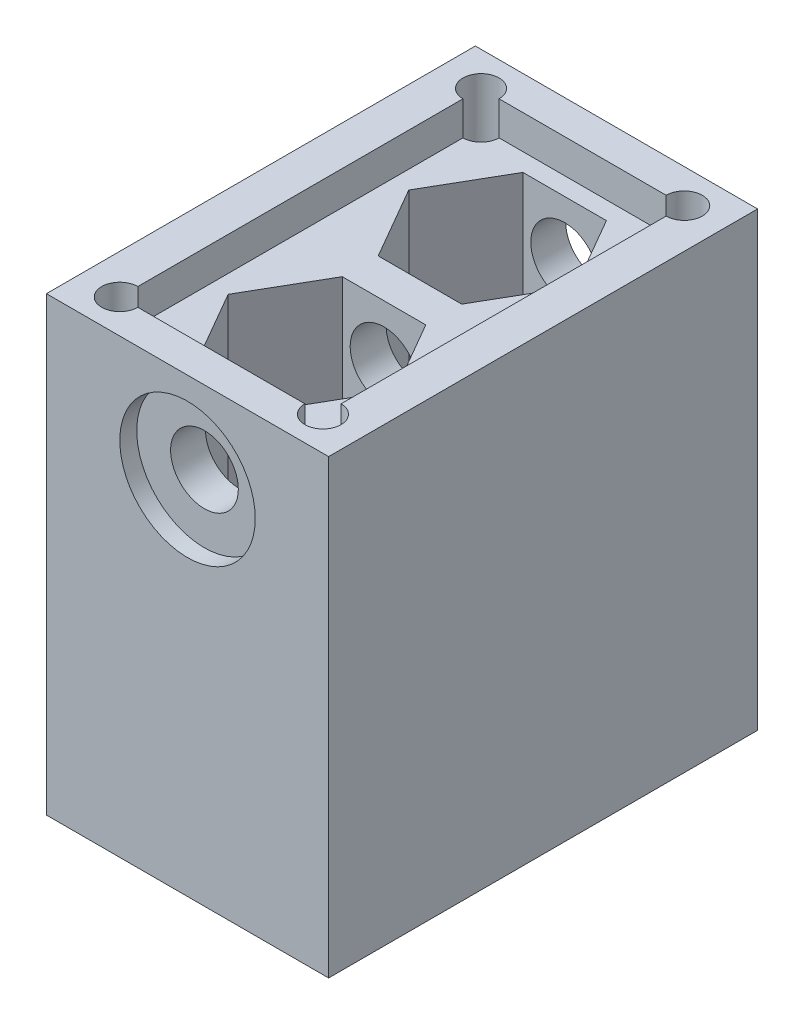
ISO-10303-21;
HEADER;
FILE_DESCRIPTION(('STEP AP214'),'2;1');
FILE_NAME('part.step','',(''),(''),'','','');
FILE_SCHEMA(('AUTOMOTIVE_DESIGN { 1 0 10303 214 1 1 1 1 }'));
ENDSEC;
DATA;
#1=APPLICATION_CONTEXT('core data for automotive mechanical design processes');
#2=APPLICATION_PROTOCOL_DEFINITION('international standard','automotive_design',2000,#1);
#3=PRODUCT_CONTEXT('',#1,'mechanical');
#4=PRODUCT('Part','Part','',(#3));
#5=PRODUCT_RELATED_PRODUCT_CATEGORY('part','',(#4));
#6=PRODUCT_DEFINITION_FORMATION('','',#4);
#7=PRODUCT_DEFINITION_CONTEXT('part definition',#1,'design');
#8=PRODUCT_DEFINITION('design','',#6,#7);
#9=PRODUCT_DEFINITION_SHAPE('','',#8);
#10=(LENGTH_UNIT() NAMED_UNIT(*) SI_UNIT(.MILLI.,.METRE.));
#11=(NAMED_UNIT(*) PLANE_ANGLE_UNIT() SI_UNIT($,.RADIAN.));
#12=(NAMED_UNIT(*) SI_UNIT($,.STERADIAN.) SOLID_ANGLE_UNIT());
#13=UNCERTAINTY_MEASURE_WITH_UNIT(LENGTH_MEASURE(1.E-05),#10,'distance_accuracy_value','');
#14=(GEOMETRIC_REPRESENTATION_CONTEXT(3) GLOBAL_UNCERTAINTY_ASSIGNED_CONTEXT((#13)) GLOBAL_UNIT_ASSIGNED_CONTEXT((#10,
#11,#12)) REPRESENTATION_CONTEXT('',''));
#15=CARTESIAN_POINT('',(0.,0.,0.));
#16=DIRECTION('',(0.,0.,1.));
#17=DIRECTION('',(1.,0.,0.));
#18=AXIS2_PLACEMENT_3D('',#15,#16,#17);
#19=CARTESIAN_POINT('',(0.,32.,-19.));
#20=DIRECTION('',(0.,0.,1.));
#21=DIRECTION('',(1.,0.,0.));
#22=AXIS2_PLACEMENT_3D('',#19,#20,#21);
#23=CYLINDRICAL_SURFACE('',#22,3.);
#24=CARTESIAN_POINT('',(0.,32.,14.4085879880048));
#25=DIRECTION('',(0.,0.,1.));
#26=DIRECTION('',(1.,0.,0.));
#27=AXIS2_PLACEMENT_3D('',#24,#25,#26);
#28=CIRCLE('',#27,3.);
#29=CARTESIAN_POINT('',(3.,32.,14.4085879880048));
#30=VERTEX_POINT('',#29);
#31=EDGE_CURVE('E320',#30,#30,#28,.F.);
#32=ORIENTED_EDGE('',*,*,#31,.T.);
#33=EDGE_LOOP('',(#32));
#34=FACE_BOUND('',#33,.T.);
#35=CARTESIAN_POINT('',(0.,32.,17.5));
#36=DIRECTION('',(0.,0.,1.));
#37=DIRECTION('',(1.,0.,0.));
#38=AXIS2_PLACEMENT_3D('',#35,#36,#37);
#39=CIRCLE('',#38,3.);
#40=CARTESIAN_POINT('',(3.,32.,17.5));
#41=VERTEX_POINT('',#40);
#42=EDGE_CURVE('E39',#41,#41,#39,.F.);
#43=ORIENTED_EDGE('',*,*,#42,.F.);
#44=EDGE_LOOP('',(#43));
#45=FACE_BOUND('',#44,.T.);
#46=ADVANCED_FACE('F35',(#34,#45),#23,.F.);
#47=CARTESIAN_POINT('',(0.,32.,-14.4085879880049));
#48=DIRECTION('',(0.,0.,-1.));
#49=DIRECTION('',(-1.,0.,0.));
#50=AXIS2_PLACEMENT_3D('',#47,#48,#49);
#51=CIRCLE('',#50,3.);
#52=CARTESIAN_POINT('',(-3.,32.,-14.4085879880049));
#53=VERTEX_POINT('',#52);
#54=EDGE_CURVE('E276',#53,#53,#51,.F.);
#55=ORIENTED_EDGE('',*,*,#54,.T.);
#56=EDGE_LOOP('',(#55));
#57=FACE_BOUND('',#56,.T.);
#58=CARTESIAN_POINT('',(0.,32.,-17.5));
#59=DIRECTION('',(0.,0.,-1.));
#60=DIRECTION('',(-1.,0.,0.));
#61=AXIS2_PLACEMENT_3D('',#58,#59,#60);
#62=CIRCLE('',#61,3.);
#63=CARTESIAN_POINT('',(-3.,32.,-17.5));
#64=VERTEX_POINT('',#63);
#65=EDGE_CURVE('E220',#64,#64,#62,.F.);
#66=ORIENTED_EDGE('',*,*,#65,.F.);
#67=EDGE_LOOP('',(#66));
#68=FACE_BOUND('',#67,.T.);
#69=ADVANCED_FACE('F481',(#57,#68),#23,.F.);
#70=CARTESIAN_POINT('',(3.70000000000001,22.,1.59141201199515));
#71=DIRECTION('',(0.,0.,-1.));
#72=DIRECTION('',(-1.,0.,0.));
#73=AXIS2_PLACEMENT_3D('',#70,#71,#72);
#74=PLANE('',#73);
#75=CARTESIAN_POINT('',(0.,32.,1.59141201199515));
#76=DIRECTION('',(0.,0.,-1.));
#77=DIRECTION('',(-1.,0.,0.));
#78=AXIS2_PLACEMENT_3D('',#75,#76,#77);
#79=CIRCLE('',#78,3.);
#80=CARTESIAN_POINT('',(-3.,32.,1.59141201199515));
#81=VERTEX_POINT('',#80);
#82=EDGE_CURVE('E316',#81,#81,#79,.F.);
#83=ORIENTED_EDGE('',*,*,#82,.F.);
#84=EDGE_LOOP('',(#83));
#85=FACE_BOUND('',#84,.T.);
#86=DIRECTION('',(1.,0.,0.));
#87=VECTOR('',#86,1.);
#88=CARTESIAN_POINT('',(3.70000000000001,37.,1.59141201199515));
#89=LINE('',#88,#87);
#90=CARTESIAN_POINT('',(-3.7,37.,1.59141201199515));
#91=VERTEX_POINT('',#90);
#92=CARTESIAN_POINT('',(3.70000000000001,37.,1.59141201199515));
#93=VERTEX_POINT('',#92);
#94=EDGE_CURVE('E422',#91,#93,#89,.T.);
#95=ORIENTED_EDGE('',*,*,#94,.F.);
#96=DIRECTION('',(0.,1.,0.));
#97=VECTOR('',#96,1.);
#98=CARTESIAN_POINT('',(-3.7,22.,1.59141201199515));
#99=LINE('',#98,#97);
#100=CARTESIAN_POINT('',(-3.7,22.,1.59141201199515));
#101=VERTEX_POINT('',#100);
#102=EDGE_CURVE('E302',#101,#91,#99,.T.);
#103=ORIENTED_EDGE('',*,*,#102,.F.);
#104=DIRECTION('',(-1.,0.,0.));
#105=VECTOR('',#104,1.);
#106=CARTESIAN_POINT('',(3.70000000000001,22.,1.59141201199515));
#107=LINE('',#106,#105);
#108=CARTESIAN_POINT('',(3.70000000000001,22.,1.59141201199515));
#109=VERTEX_POINT('',#108);
#110=EDGE_CURVE('E291',#109,#101,#107,.T.);
#111=ORIENTED_EDGE('',*,*,#110,.F.);
#112=DIRECTION('',(0.,1.,0.));
#113=VECTOR('',#112,1.);
#114=CARTESIAN_POINT('',(3.70000000000001,22.,1.59141201199515));
#115=LINE('',#114,#113);
#116=EDGE_CURVE('E305',#109,#93,#115,.T.);
#117=ORIENTED_EDGE('',*,*,#116,.T.);
#118=EDGE_LOOP('',(#95,#103,#111,#117));
#119=FACE_BOUND('',#118,.T.);
#120=ADVANCED_FACE('F490',(#85,#119),#74,.F.);
#121=CARTESIAN_POINT('',(-3.69999999999999,22.,14.4085879880048));
#122=DIRECTION('',(0.,0.,1.));
#123=DIRECTION('',(1.,0.,0.));
#124=AXIS2_PLACEMENT_3D('',#121,#122,#123);
#125=PLANE('',#124);
#126=ORIENTED_EDGE('',*,*,#31,.F.);
#127=EDGE_LOOP('',(#126));
#128=FACE_BOUND('',#127,.T.);
#129=DIRECTION('',(-1.,0.,0.));
#130=VECTOR('',#129,1.);
#131=CARTESIAN_POINT('',(-3.69999999999999,37.,14.4085879880048));
#132=LINE('',#131,#130);
#133=CARTESIAN_POINT('',(3.70000000000001,37.,14.4085879880048));
#134=VERTEX_POINT('',#133);
#135=CARTESIAN_POINT('',(-3.69999999999999,37.,14.4085879880048));
#136=VERTEX_POINT('',#135);
#137=EDGE_CURVE('E420',#134,#136,#132,.T.);
#138=ORIENTED_EDGE('',*,*,#137,.F.);
#139=DIRECTION('',(0.,1.,0.));
#140=VECTOR('',#139,1.);
#141=CARTESIAN_POINT('',(3.70000000000001,22.,14.4085879880048));
#142=LINE('',#141,#140);
#143=CARTESIAN_POINT('',(3.70000000000001,22.,14.4085879880048));
#144=VERTEX_POINT('',#143);
#145=EDGE_CURVE('E311',#144,#134,#142,.T.);
#146=ORIENTED_EDGE('',*,*,#145,.F.);
#147=DIRECTION('',(1.,0.,0.));
#148=VECTOR('',#147,1.);
#149=CARTESIAN_POINT('',(-3.69999999999999,22.,14.4085879880048));
#150=LINE('',#149,#148);
#151=CARTESIAN_POINT('',(-3.69999999999999,22.,14.4085879880048));
#152=VERTEX_POINT('',#151);
#153=EDGE_CURVE('E282',#152,#144,#150,.T.);
#154=ORIENTED_EDGE('',*,*,#153,.F.);
#155=DIRECTION('',(0.,1.,0.));
#156=VECTOR('',#155,1.);
#157=CARTESIAN_POINT('',(-3.69999999999999,22.,14.4085879880048));
#158=LINE('',#157,#156);
#159=EDGE_CURVE('E297',#152,#136,#158,.T.);
#160=ORIENTED_EDGE('',*,*,#159,.T.);
#161=EDGE_LOOP('',(#138,#146,#154,#160));
#162=FACE_BOUND('',#161,.T.);
#163=ADVANCED_FACE('F512',(#128,#162),#125,.F.);
#164=CARTESIAN_POINT('',(-7.4,22.,7.99999999999999));
#165=DIRECTION('',(-0.866025403784439,0.,0.5));
#166=DIRECTION('',(0.5,0.,0.866025403784439));
#167=AXIS2_PLACEMENT_3D('',#164,#165,#166);
#168=PLANE('',#167);
#169=DIRECTION('',(-0.5,0.,-0.866025403784439));
#170=VECTOR('',#169,1.);
#171=CARTESIAN_POINT('',(-7.4,37.,7.99999999999999));
#172=LINE('',#171,#170);
#173=CARTESIAN_POINT('',(-7.4,37.,7.99999999999999));
#174=VERTEX_POINT('',#173);
#175=EDGE_CURVE('E426',#136,#174,#172,.T.);
#176=ORIENTED_EDGE('',*,*,#175,.F.);
#177=ORIENTED_EDGE('',*,*,#159,.F.);
#178=DIRECTION('',(0.5,0.,0.866025403784439));
#179=VECTOR('',#178,1.);
#180=CARTESIAN_POINT('',(-7.4,22.,7.99999999999999));
#181=LINE('',#180,#179);
#182=CARTESIAN_POINT('',(-7.4,22.,7.99999999999999));
#183=VERTEX_POINT('',#182);
#184=EDGE_CURVE('E279',#183,#152,#181,.T.);
#185=ORIENTED_EDGE('',*,*,#184,.F.);
#186=DIRECTION('',(0.,1.,0.));
#187=VECTOR('',#186,1.);
#188=CARTESIAN_POINT('',(-7.4,22.,7.99999999999999));
#189=LINE('',#188,#187);
#190=EDGE_CURVE('E298',#183,#174,#189,.T.);
#191=ORIENTED_EDGE('',*,*,#190,.T.);
#192=EDGE_LOOP('',(#176,#177,#185,#191));
#193=FACE_BOUND('',#192,.T.);
#194=ADVANCED_FACE('F535',(#193),#168,.F.);
#195=CARTESIAN_POINT('',(-3.7,22.,1.59141201199515));
#196=DIRECTION('',(-0.866025403784438,0.,-0.5));
#197=DIRECTION('',(-0.5,0.,0.866025403784438));
#198=AXIS2_PLACEMENT_3D('',#195,#196,#197);
#199=PLANE('',#198);
#200=DIRECTION('',(0.5,0.,-0.866025403784438));
#201=VECTOR('',#200,1.);
#202=CARTESIAN_POINT('',(-3.7,37.,1.59141201199515));
#203=LINE('',#202,#201);
#204=EDGE_CURVE('E424',#174,#91,#203,.T.);
#205=ORIENTED_EDGE('',*,*,#204,.F.);
#206=ORIENTED_EDGE('',*,*,#190,.F.);
#207=DIRECTION('',(-0.5,0.,0.866025403784438));
#208=VECTOR('',#207,1.);
#209=CARTESIAN_POINT('',(-3.7,22.,1.59141201199515));
#210=LINE('',#209,#208);
#211=EDGE_CURVE('E294',#101,#183,#210,.T.);
#212=ORIENTED_EDGE('',*,*,#211,.F.);
#213=ORIENTED_EDGE('',*,*,#102,.T.);
#214=EDGE_LOOP('',(#205,#206,#212,#213));
#215=FACE_BOUND('',#214,.T.);
#216=ADVANCED_FACE('F519',(#215),#199,.F.);
#217=CARTESIAN_POINT('',(7.40000000000001,22.,8.));
#218=DIRECTION('',(0.866025403784439,0.,-0.5));
#219=DIRECTION('',(-0.5,0.,-0.866025403784439));
#220=AXIS2_PLACEMENT_3D('',#217,#218,#219);
#221=PLANE('',#220);
#222=DIRECTION('',(0.5,0.,0.866025403784439));
#223=VECTOR('',#222,1.);
#224=CARTESIAN_POINT('',(7.40000000000001,37.,8.));
#225=LINE('',#224,#223);
#226=CARTESIAN_POINT('',(7.40000000000001,37.,8.));
#227=VERTEX_POINT('',#226);
#228=EDGE_CURVE('E52',#93,#227,#225,.T.);
#229=ORIENTED_EDGE('',*,*,#228,.F.);
#230=ORIENTED_EDGE('',*,*,#116,.F.);
#231=DIRECTION('',(-0.5,0.,-0.866025403784439));
#232=VECTOR('',#231,1.);
#233=CARTESIAN_POINT('',(7.40000000000001,22.,8.));
#234=LINE('',#233,#232);
#235=CARTESIAN_POINT('',(7.40000000000001,22.,8.));
#236=VERTEX_POINT('',#235);
#237=EDGE_CURVE('E288',#236,#109,#234,.T.);
#238=ORIENTED_EDGE('',*,*,#237,.F.);
#239=DIRECTION('',(0.,1.,0.));
#240=VECTOR('',#239,1.);
#241=CARTESIAN_POINT('',(7.40000000000001,22.,8.));
#242=LINE('',#241,#240);
#243=EDGE_CURVE('E308',#236,#227,#242,.T.);
#244=ORIENTED_EDGE('',*,*,#243,.T.);
#245=EDGE_LOOP('',(#229,#230,#238,#244));
#246=FACE_BOUND('',#245,.T.);
#247=ADVANCED_FACE('F527',(#246),#221,.F.);
#248=CARTESIAN_POINT('',(3.70000000000001,22.,14.4085879880048));
#249=DIRECTION('',(0.866025403784439,0.,0.5));
#250=DIRECTION('',(0.5,0.,-0.866025403784439));
#251=AXIS2_PLACEMENT_3D('',#248,#249,#250);
#252=PLANE('',#251);
#253=DIRECTION('',(-0.5,0.,0.866025403784439));
#254=VECTOR('',#253,1.);
#255=CARTESIAN_POINT('',(3.70000000000001,37.,14.4085879880048));
#256=LINE('',#255,#254);
#257=EDGE_CURVE('E417',#227,#134,#256,.T.);
#258=ORIENTED_EDGE('',*,*,#257,.F.);
#259=ORIENTED_EDGE('',*,*,#243,.F.);
#260=DIRECTION('',(0.5,0.,-0.866025403784439));
#261=VECTOR('',#260,1.);
#262=CARTESIAN_POINT('',(3.70000000000001,22.,14.4085879880048));
#263=LINE('',#262,#261);
#264=EDGE_CURVE('E285',#144,#236,#263,.T.);
#265=ORIENTED_EDGE('',*,*,#264,.F.);
#266=ORIENTED_EDGE('',*,*,#145,.T.);
#267=EDGE_LOOP('',(#258,#259,#265,#266));
#268=FACE_BOUND('',#267,.T.);
#269=ADVANCED_FACE('F529',(#268),#252,.F.);
#270=CARTESIAN_POINT('',(3.70000000000001,22.,-14.4085879880049));
#271=DIRECTION('',(0.,0.,-1.));
#272=DIRECTION('',(-1.,0.,0.));
#273=AXIS2_PLACEMENT_3D('',#270,#271,#272);
#274=PLANE('',#273);
#275=ORIENTED_EDGE('',*,*,#54,.F.);
#276=EDGE_LOOP('',(#275));
#277=FACE_BOUND('',#276,.T.);
#278=DIRECTION('',(1.,0.,0.));
#279=VECTOR('',#278,1.);
#280=CARTESIAN_POINT('',(3.70000000000001,37.,-14.4085879880049));
#281=LINE('',#280,#279);
#282=CARTESIAN_POINT('',(-3.7,37.,-14.4085879880049));
#283=VERTEX_POINT('',#282);
#284=CARTESIAN_POINT('',(3.70000000000001,37.,-14.4085879880049));
#285=VERTEX_POINT('',#284);
#286=EDGE_CURVE('E411',#283,#285,#281,.T.);
#287=ORIENTED_EDGE('',*,*,#286,.F.);
#288=DIRECTION('',(0.,1.,0.));
#289=VECTOR('',#288,1.);
#290=CARTESIAN_POINT('',(-3.7,22.,-14.4085879880049));
#291=LINE('',#290,#289);
#292=CARTESIAN_POINT('',(-3.7,22.,-14.4085879880049));
#293=VERTEX_POINT('',#292);
#294=EDGE_CURVE('E254',#293,#283,#291,.T.);
#295=ORIENTED_EDGE('',*,*,#294,.F.);
#296=DIRECTION('',(-1.,0.,0.));
#297=VECTOR('',#296,1.);
#298=CARTESIAN_POINT('',(3.70000000000001,22.,-14.4085879880049));
#299=LINE('',#298,#297);
#300=CARTESIAN_POINT('',(3.70000000000001,22.,-14.4085879880049));
#301=VERTEX_POINT('',#300);
#302=EDGE_CURVE('E230',#301,#293,#299,.T.);
#303=ORIENTED_EDGE('',*,*,#302,.F.);
#304=DIRECTION('',(0.,1.,0.));
#305=VECTOR('',#304,1.);
#306=CARTESIAN_POINT('',(3.70000000000001,22.,-14.4085879880049));
#307=LINE('',#306,#305);
#308=EDGE_CURVE('E255',#301,#285,#307,.T.);
#309=ORIENTED_EDGE('',*,*,#308,.T.);
#310=EDGE_LOOP('',(#287,#295,#303,#309));
#311=FACE_BOUND('',#310,.T.);
#312=ADVANCED_FACE('F584',(#277,#311),#274,.F.);
#313=CARTESIAN_POINT('',(-3.70000000000001,22.,-1.59141201199515));
#314=DIRECTION('',(0.,0.,1.));
#315=DIRECTION('',(1.,0.,0.));
#316=AXIS2_PLACEMENT_3D('',#313,#314,#315);
#317=PLANE('',#316);
#318=CARTESIAN_POINT('',(0.,32.,-1.59141201199515));
#319=DIRECTION('',(0.,0.,1.));
#320=DIRECTION('',(1.,0.,0.));
#321=AXIS2_PLACEMENT_3D('',#318,#319,#320);
#322=CIRCLE('',#321,3.);
#323=CARTESIAN_POINT('',(3.,32.,-1.59141201199515));
#324=VERTEX_POINT('',#323);
#325=EDGE_CURVE('E273',#324,#324,#322,.F.);
#326=ORIENTED_EDGE('',*,*,#325,.F.);
#327=EDGE_LOOP('',(#326));
#328=FACE_BOUND('',#327,.T.);
#329=DIRECTION('',(-1.,0.,0.));
#330=VECTOR('',#329,1.);
#331=CARTESIAN_POINT('',(-3.70000000000001,37.,-1.59141201199515));
#332=LINE('',#331,#330);
#333=CARTESIAN_POINT('',(3.7,37.,-1.59141201199515));
#334=VERTEX_POINT('',#333);
#335=CARTESIAN_POINT('',(-3.70000000000001,37.,-1.59141201199515));
#336=VERTEX_POINT('',#335);
#337=EDGE_CURVE('E409',#334,#336,#332,.T.);
#338=ORIENTED_EDGE('',*,*,#337,.F.);
#339=DIRECTION('',(0.,1.,0.));
#340=VECTOR('',#339,1.);
#341=CARTESIAN_POINT('',(3.7,22.,-1.59141201199515));
#342=LINE('',#341,#340);
#343=CARTESIAN_POINT('',(3.7,22.,-1.59141201199515));
#344=VERTEX_POINT('',#343);
#345=EDGE_CURVE('E262',#344,#334,#342,.T.);
#346=ORIENTED_EDGE('',*,*,#345,.F.);
#347=DIRECTION('',(1.,0.,0.));
#348=VECTOR('',#347,1.);
#349=CARTESIAN_POINT('',(-3.70000000000001,22.,-1.59141201199515));
#350=LINE('',#349,#348);
#351=CARTESIAN_POINT('',(-3.70000000000001,22.,-1.59141201199515));
#352=VERTEX_POINT('',#351);
#353=EDGE_CURVE('E245',#352,#344,#350,.T.);
#354=ORIENTED_EDGE('',*,*,#353,.F.);
#355=DIRECTION('',(0.,1.,0.));
#356=VECTOR('',#355,1.);
#357=CARTESIAN_POINT('',(-3.70000000000001,22.,-1.59141201199515));
#358=LINE('',#357,#356);
#359=EDGE_CURVE('E265',#352,#336,#358,.T.);
#360=ORIENTED_EDGE('',*,*,#359,.T.);
#361=EDGE_LOOP('',(#338,#346,#354,#360));
#362=FACE_BOUND('',#361,.T.);
#363=ADVANCED_FACE('F577',(#328,#362),#317,.F.);
#364=CARTESIAN_POINT('',(7.40000000000001,22.,-8.));
#365=DIRECTION('',(0.866025403784439,0.,-0.5));
#366=DIRECTION('',(-0.5,0.,-0.866025403784439));
#367=AXIS2_PLACEMENT_3D('',#364,#365,#366);
#368=PLANE('',#367);
#369=DIRECTION('',(0.5,0.,0.866025403784439));
#370=VECTOR('',#369,1.);
#371=CARTESIAN_POINT('',(7.40000000000001,37.,-8.));
#372=LINE('',#371,#370);
#373=CARTESIAN_POINT('',(7.40000000000001,37.,-8.));
#374=VERTEX_POINT('',#373);
#375=EDGE_CURVE('E415',#285,#374,#372,.T.);
#376=ORIENTED_EDGE('',*,*,#375,.F.);
#377=ORIENTED_EDGE('',*,*,#308,.F.);
#378=DIRECTION('',(-0.5,0.,-0.866025403784439));
#379=VECTOR('',#378,1.);
#380=CARTESIAN_POINT('',(7.40000000000001,22.,-8.));
#381=LINE('',#380,#379);
#382=CARTESIAN_POINT('',(7.40000000000001,22.,-8.));
#383=VERTEX_POINT('',#382);
#384=EDGE_CURVE('E251',#383,#301,#381,.T.);
#385=ORIENTED_EDGE('',*,*,#384,.F.);
#386=DIRECTION('',(0.,1.,0.));
#387=VECTOR('',#386,1.);
#388=CARTESIAN_POINT('',(7.40000000000001,22.,-8.));
#389=LINE('',#388,#387);
#390=EDGE_CURVE('E259',#383,#374,#389,.T.);
#391=ORIENTED_EDGE('',*,*,#390,.T.);
#392=EDGE_LOOP('',(#376,#377,#385,#391));
#393=FACE_BOUND('',#392,.T.);
#394=ADVANCED_FACE('F573',(#393),#368,.F.);
#395=CARTESIAN_POINT('',(3.7,22.,-1.59141201199515));
#396=DIRECTION('',(0.866025403784438,0.,0.5));
#397=DIRECTION('',(0.5,0.,-0.866025403784438));
#398=AXIS2_PLACEMENT_3D('',#395,#396,#397);
#399=PLANE('',#398);
#400=DIRECTION('',(-0.5,0.,0.866025403784438));
#401=VECTOR('',#400,1.);
#402=CARTESIAN_POINT('',(3.7,37.,-1.59141201199515));
#403=LINE('',#402,#401);
#404=EDGE_CURVE('E413',#374,#334,#403,.T.);
#405=ORIENTED_EDGE('',*,*,#404,.F.);
#406=ORIENTED_EDGE('',*,*,#390,.F.);
#407=DIRECTION('',(0.5,0.,-0.866025403784438));
#408=VECTOR('',#407,1.);
#409=CARTESIAN_POINT('',(3.7,22.,-1.59141201199515));
#410=LINE('',#409,#408);
#411=EDGE_CURVE('E248',#344,#383,#410,.T.);
#412=ORIENTED_EDGE('',*,*,#411,.F.);
#413=ORIENTED_EDGE('',*,*,#345,.T.);
#414=EDGE_LOOP('',(#405,#406,#412,#413));
#415=FACE_BOUND('',#414,.T.);
#416=ADVANCED_FACE('F576',(#415),#399,.F.);
#417=CARTESIAN_POINT('',(-7.40000000000001,22.,-8.));
#418=DIRECTION('',(-0.866025403784439,0.,0.5));
#419=DIRECTION('',(0.5,0.,0.866025403784439));
#420=AXIS2_PLACEMENT_3D('',#417,#418,#419);
#421=PLANE('',#420);
#422=DIRECTION('',(-0.5,0.,-0.866025403784439));
#423=VECTOR('',#422,1.);
#424=CARTESIAN_POINT('',(-7.40000000000001,37.,-8.));
#425=LINE('',#424,#423);
#426=CARTESIAN_POINT('',(-7.40000000000001,37.,-8.));
#427=VERTEX_POINT('',#426);
#428=EDGE_CURVE('E60',#336,#427,#425,.T.);
#429=ORIENTED_EDGE('',*,*,#428,.F.);
#430=ORIENTED_EDGE('',*,*,#359,.F.);
#431=DIRECTION('',(0.5,0.,0.866025403784439));
#432=VECTOR('',#431,1.);
#433=CARTESIAN_POINT('',(-7.40000000000001,22.,-8.));
#434=LINE('',#433,#432);
#435=CARTESIAN_POINT('',(-7.40000000000001,22.,-8.));
#436=VERTEX_POINT('',#435);
#437=EDGE_CURVE('E242',#436,#352,#434,.T.);
#438=ORIENTED_EDGE('',*,*,#437,.F.);
#439=DIRECTION('',(0.,1.,0.));
#440=VECTOR('',#439,1.);
#441=CARTESIAN_POINT('',(-7.40000000000001,22.,-8.));
#442=LINE('',#441,#440);
#443=EDGE_CURVE('E268',#436,#427,#442,.T.);
#444=ORIENTED_EDGE('',*,*,#443,.T.);
#445=EDGE_LOOP('',(#429,#430,#438,#444));
#446=FACE_BOUND('',#445,.T.);
#447=ADVANCED_FACE('F553',(#446),#421,.F.);
#448=CARTESIAN_POINT('',(-3.7,22.,-14.4085879880049));
#449=DIRECTION('',(-0.866025403784438,0.,-0.5));
#450=DIRECTION('',(-0.5,0.,0.866025403784439));
#451=AXIS2_PLACEMENT_3D('',#448,#449,#450);
#452=PLANE('',#451);
#453=DIRECTION('',(0.5,0.,-0.866025403784439));
#454=VECTOR('',#453,1.);
#455=CARTESIAN_POINT('',(-3.7,37.,-14.4085879880049));
#456=LINE('',#455,#454);
#457=EDGE_CURVE('E406',#427,#283,#456,.T.);
#458=ORIENTED_EDGE('',*,*,#457,.F.);
#459=ORIENTED_EDGE('',*,*,#443,.F.);
#460=DIRECTION('',(-0.5,0.,0.866025403784439));
#461=VECTOR('',#460,1.);
#462=CARTESIAN_POINT('',(-3.7,22.,-14.4085879880049));
#463=LINE('',#462,#461);
#464=EDGE_CURVE('E239',#293,#436,#463,.T.);
#465=ORIENTED_EDGE('',*,*,#464,.F.);
#466=ORIENTED_EDGE('',*,*,#294,.T.);
#467=EDGE_LOOP('',(#458,#459,#465,#466));
#468=FACE_BOUND('',#467,.T.);
#469=ADVANCED_FACE('F548',(#468),#452,.F.);
#470=CARTESIAN_POINT('',(0.,0.,-8.));
#471=DIRECTION('',(0.,1.,0.));
#472=DIRECTION('',(0.,0.,1.));
#473=AXIS2_PLACEMENT_3D('',#470,#471,#472);
#474=CYLINDRICAL_SURFACE('',#473,4.15);
#475=CARTESIAN_POINT('',(0.,0.,-8.));
#476=DIRECTION('',(0.,1.,0.));
#477=DIRECTION('',(0.,0.,1.));
#478=AXIS2_PLACEMENT_3D('',#475,#476,#477);
#479=CIRCLE('',#478,4.15);
#480=CARTESIAN_POINT('',(0.,0.,-3.85));
#481=VERTEX_POINT('',#480);
#482=EDGE_CURVE('E319',#481,#481,#479,.T.);
#483=ORIENTED_EDGE('',*,*,#482,.F.);
#484=EDGE_LOOP('',(#483));
#485=FACE_BOUND('',#484,.T.);
#486=CARTESIAN_POINT('',(0.,22.,-8.));
#487=DIRECTION('',(0.,1.,0.));
#488=DIRECTION('',(0.,0.,1.));
#489=AXIS2_PLACEMENT_3D('',#486,#487,#488);
#490=CIRCLE('',#489,4.15);
#491=CARTESIAN_POINT('',(0.,22.,-3.85));
#492=VERTEX_POINT('',#491);
#493=EDGE_CURVE('E258',#492,#492,#490,.F.);
#494=ORIENTED_EDGE('',*,*,#493,.F.);
#495=EDGE_LOOP('',(#494));
#496=FACE_BOUND('',#495,.T.);
#497=ADVANCED_FACE('F504',(#485,#496),#474,.F.);
#498=CARTESIAN_POINT('',(0.,0.,8.));
#499=DIRECTION('',(0.,1.,0.));
#500=DIRECTION('',(0.,0.,1.));
#501=AXIS2_PLACEMENT_3D('',#498,#499,#500);
#502=CYLINDRICAL_SURFACE('',#501,4.15);
#503=CARTESIAN_POINT('',(0.,0.,8.));
#504=DIRECTION('',(0.,1.,0.));
#505=DIRECTION('',(0.,0.,1.));
#506=AXIS2_PLACEMENT_3D('',#503,#504,#505);
#507=CIRCLE('',#506,4.15);
#508=CARTESIAN_POINT('',(0.,0.,12.15));
#509=VERTEX_POINT('',#508);
#510=EDGE_CURVE('E323',#509,#509,#507,.T.);
#511=ORIENTED_EDGE('',*,*,#510,.F.);
#512=EDGE_LOOP('',(#511));
#513=FACE_BOUND('',#512,.T.);
#514=CARTESIAN_POINT('',(0.,22.,8.));
#515=DIRECTION('',(0.,1.,0.));
#516=DIRECTION('',(0.,0.,1.));
#517=AXIS2_PLACEMENT_3D('',#514,#515,#516);
#518=CIRCLE('',#517,4.15);
#519=CARTESIAN_POINT('',(0.,22.,12.15));
#520=VERTEX_POINT('',#519);
#521=EDGE_CURVE('E301',#520,#520,#518,.F.);
#522=ORIENTED_EDGE('',*,*,#521,.F.);
#523=EDGE_LOOP('',(#522));
#524=FACE_BOUND('',#523,.T.);
#525=ADVANCED_FACE('F496',(#513,#524),#502,.F.);
#526=ORIENTED_EDGE('',*,*,#325,.T.);
#527=EDGE_LOOP('',(#526));
#528=FACE_BOUND('',#527,.T.);
#529=ORIENTED_EDGE('',*,*,#82,.T.);
#530=EDGE_LOOP('',(#529));
#531=FACE_BOUND('',#530,.T.);
#532=ADVANCED_FACE('F484',(#528,#531),#23,.F.);
#533=CARTESIAN_POINT('',(-12.5,40.,19.));
#534=DIRECTION('',(1.,0.,0.));
#535=DIRECTION('',(0.,0.,-1.));
#536=AXIS2_PLACEMENT_3D('',#533,#534,#535);
#537=PLANE('',#536);
#538=DIRECTION('',(0.,0.,1.));
#539=VECTOR('',#538,1.);
#540=CARTESIAN_POINT('',(-12.5,0.,19.));
#541=LINE('',#540,#539);
#542=CARTESIAN_POINT('',(-12.5,0.,-19.));
#543=VERTEX_POINT('',#542);
#544=CARTESIAN_POINT('',(-12.5,0.,19.));
#545=VERTEX_POINT('',#544);
#546=EDGE_CURVE('E326',#543,#545,#541,.T.);
#547=ORIENTED_EDGE('',*,*,#546,.T.);
#548=DIRECTION('',(0.,-1.,0.));
#549=VECTOR('',#548,1.);
#550=CARTESIAN_POINT('',(-12.5,40.,19.));
#551=LINE('',#550,#549);
#552=CARTESIAN_POINT('',(-12.5,40.,19.));
#553=VERTEX_POINT('',#552);
#554=EDGE_CURVE('E353',#553,#545,#551,.T.);
#555=ORIENTED_EDGE('',*,*,#554,.F.);
#556=DIRECTION('',(0.,0.,1.));
#557=VECTOR('',#556,1.);
#558=CARTESIAN_POINT('',(-12.5,40.,19.));
#559=LINE('',#558,#557);
#560=CARTESIAN_POINT('',(-12.5,40.,-19.));
#561=VERTEX_POINT('',#560);
#562=EDGE_CURVE('E327',#561,#553,#559,.T.);
#563=ORIENTED_EDGE('',*,*,#562,.F.);
#564=DIRECTION('',(0.,-1.,0.));
#565=VECTOR('',#564,1.);
#566=CARTESIAN_POINT('',(-12.5,40.,-19.));
#567=LINE('',#566,#565);
#568=EDGE_CURVE('E337',#561,#543,#567,.T.);
#569=ORIENTED_EDGE('',*,*,#568,.T.);
#570=EDGE_LOOP('',(#547,#555,#563,#569));
#571=FACE_BOUND('',#570,.T.);
#572=ADVANCED_FACE('F37',(#571),#537,.F.);
#573=CARTESIAN_POINT('',(12.5,40.,19.));
#574=DIRECTION('',(0.,0.,-1.));
#575=DIRECTION('',(-1.,0.,0.));
#576=AXIS2_PLACEMENT_3D('',#573,#574,#575);
#577=PLANE('',#576);
#578=CARTESIAN_POINT('',(0.,32.,19.));
#579=DIRECTION('',(0.,0.,1.));
#580=DIRECTION('',(1.,0.,0.));
#581=AXIS2_PLACEMENT_3D('',#578,#579,#580);
#582=CIRCLE('',#581,6.);
#583=CARTESIAN_POINT('',(6.,32.,19.));
#584=VERTEX_POINT('',#583);
#585=EDGE_CURVE('E383',#584,#584,#582,.T.);
#586=ORIENTED_EDGE('',*,*,#585,.F.);
#587=EDGE_LOOP('',(#586));
#588=FACE_BOUND('',#587,.T.);
#589=DIRECTION('',(1.,0.,0.));
#590=VECTOR('',#589,1.);
#591=CARTESIAN_POINT('',(12.5,0.,19.));
#592=LINE('',#591,#590);
#593=CARTESIAN_POINT('',(12.5,0.,19.));
#594=VERTEX_POINT('',#593);
#595=EDGE_CURVE('E340',#545,#594,#592,.T.);
#596=ORIENTED_EDGE('',*,*,#595,.T.);
#597=DIRECTION('',(0.,-1.,0.));
#598=VECTOR('',#597,1.);
#599=CARTESIAN_POINT('',(12.5,40.,19.));
#600=LINE('',#599,#598);
#601=CARTESIAN_POINT('',(12.5,40.,19.));
#602=VERTEX_POINT('',#601);
#603=EDGE_CURVE('E350',#602,#594,#600,.T.);
#604=ORIENTED_EDGE('',*,*,#603,.F.);
#605=DIRECTION('',(1.,0.,0.));
#606=VECTOR('',#605,1.);
#607=CARTESIAN_POINT('',(12.5,40.,19.));
#608=LINE('',#607,#606);
#609=EDGE_CURVE('E330',#553,#602,#608,.T.);
#610=ORIENTED_EDGE('',*,*,#609,.F.);
#611=ORIENTED_EDGE('',*,*,#554,.T.);
#612=EDGE_LOOP('',(#596,#604,#610,#611));
#613=FACE_BOUND('',#612,.T.);
#614=ADVANCED_FACE('F502',(#588,#613),#577,.F.);
#615=CARTESIAN_POINT('',(12.5,40.,19.));
#616=DIRECTION('',(-1.,0.,0.));
#617=DIRECTION('',(0.,0.,1.));
#618=AXIS2_PLACEMENT_3D('',#615,#616,#617);
#619=PLANE('',#618);
#620=DIRECTION('',(0.,0.,-1.));
#621=VECTOR('',#620,1.);
#622=CARTESIAN_POINT('',(12.5,0.,19.));
#623=LINE('',#622,#621);
#624=CARTESIAN_POINT('',(12.5,0.,-19.));
#625=VERTEX_POINT('',#624);
#626=EDGE_CURVE('E342',#594,#625,#623,.T.);
#627=ORIENTED_EDGE('',*,*,#626,.T.);
#628=DIRECTION('',(0.,-1.,0.));
#629=VECTOR('',#628,1.);
#630=CARTESIAN_POINT('',(12.5,40.,-19.));
#631=LINE('',#630,#629);
#632=CARTESIAN_POINT('',(12.5,40.,-19.));
#633=VERTEX_POINT('',#632);
#634=EDGE_CURVE('E347',#633,#625,#631,.T.);
#635=ORIENTED_EDGE('',*,*,#634,.F.);
#636=DIRECTION('',(0.,0.,-1.));
#637=VECTOR('',#636,1.);
#638=CARTESIAN_POINT('',(12.5,40.,19.));
#639=LINE('',#638,#637);
#640=EDGE_CURVE('E333',#602,#633,#639,.T.);
#641=ORIENTED_EDGE('',*,*,#640,.F.);
#642=ORIENTED_EDGE('',*,*,#603,.T.);
#643=EDGE_LOOP('',(#627,#635,#641,#642));
#644=FACE_BOUND('',#643,.T.);
#645=ADVANCED_FACE('F710',(#644),#619,.F.);
#646=CARTESIAN_POINT('',(12.5,40.,-19.));
#647=DIRECTION('',(0.,0.,1.));
#648=DIRECTION('',(1.,0.,0.));
#649=AXIS2_PLACEMENT_3D('',#646,#647,#648);
#650=PLANE('',#649);
#651=CARTESIAN_POINT('',(0.,32.,-19.));
#652=DIRECTION('',(0.,0.,-1.));
#653=DIRECTION('',(-1.,0.,0.));
#654=AXIS2_PLACEMENT_3D('',#651,#652,#653);
#655=CIRCLE('',#654,6.);
#656=CARTESIAN_POINT('',(-6.00000000000001,32.,-19.));
#657=VERTEX_POINT('',#656);
#658=EDGE_CURVE('E376',#657,#657,#655,.T.);
#659=ORIENTED_EDGE('',*,*,#658,.F.);
#660=EDGE_LOOP('',(#659));
#661=FACE_BOUND('',#660,.T.);
#662=DIRECTION('',(-1.,0.,0.));
#663=VECTOR('',#662,1.);
#664=CARTESIAN_POINT('',(12.5,0.,-19.));
#665=LINE('',#664,#663);
#666=EDGE_CURVE('E331',#625,#543,#665,.T.);
#667=ORIENTED_EDGE('',*,*,#666,.T.);
#668=ORIENTED_EDGE('',*,*,#568,.F.);
#669=DIRECTION('',(-1.,0.,0.));
#670=VECTOR('',#669,1.);
#671=CARTESIAN_POINT('',(12.5,40.,-19.));
#672=LINE('',#671,#670);
#673=EDGE_CURVE('E335',#633,#561,#672,.T.);
#674=ORIENTED_EDGE('',*,*,#673,.F.);
#675=ORIENTED_EDGE('',*,*,#634,.T.);
#676=EDGE_LOOP('',(#667,#668,#674,#675));
#677=FACE_BOUND('',#676,.T.);
#678=ADVANCED_FACE('F632',(#661,#677),#650,.F.);
#679=CARTESIAN_POINT('',(0.,40.,0.));
#680=DIRECTION('',(0.,1.,0.));
#681=DIRECTION('',(0.,0.,1.));
#682=AXIS2_PLACEMENT_3D('',#679,#680,#681);
#683=PLANE('',#682);
#684=DIRECTION('',(0.,0.,-1.));
#685=VECTOR('',#684,1.);
#686=CARTESIAN_POINT('',(9.,40.,-16.));
#687=LINE('',#686,#685);
#688=CARTESIAN_POINT('',(9.,40.,14.4));
#689=VERTEX_POINT('',#688);
#690=CARTESIAN_POINT('',(9.,40.,-14.4));
#691=VERTEX_POINT('',#690);
#692=EDGE_CURVE('E201',#689,#691,#687,.T.);
#693=ORIENTED_EDGE('',*,*,#692,.F.);
#694=CARTESIAN_POINT('',(9.,40.,16.));
#695=DIRECTION('',(0.,1.,0.));
#696=DIRECTION('',(0.,0.,1.));
#697=AXIS2_PLACEMENT_3D('',#694,#695,#696);
#698=CIRCLE('',#697,1.6);
#699=CARTESIAN_POINT('',(7.4,40.,16.));
#700=VERTEX_POINT('',#699);
#701=EDGE_CURVE('E216',#700,#689,#698,.T.);
#702=ORIENTED_EDGE('',*,*,#701,.F.);
#703=DIRECTION('',(1.,0.,0.));
#704=VECTOR('',#703,1.);
#705=CARTESIAN_POINT('',(-9.,40.,16.));
#706=LINE('',#705,#704);
#707=CARTESIAN_POINT('',(-7.4,40.,16.));
#708=VERTEX_POINT('',#707);
#709=EDGE_CURVE('E388',#708,#700,#706,.T.);
#710=ORIENTED_EDGE('',*,*,#709,.F.);
#711=CARTESIAN_POINT('',(-9.,40.,16.));
#712=DIRECTION('',(0.,1.,0.));
#713=DIRECTION('',(0.,0.,1.));
#714=AXIS2_PLACEMENT_3D('',#711,#712,#713);
#715=CIRCLE('',#714,1.6);
#716=CARTESIAN_POINT('',(-9.,40.,14.4));
#717=VERTEX_POINT('',#716);
#718=EDGE_CURVE('E233',#717,#708,#715,.T.);
#719=ORIENTED_EDGE('',*,*,#718,.F.);
#720=DIRECTION('',(0.,0.,1.));
#721=VECTOR('',#720,1.);
#722=CARTESIAN_POINT('',(-9.,40.,-16.));
#723=LINE('',#722,#721);
#724=CARTESIAN_POINT('',(-9.,40.,-14.4));
#725=VERTEX_POINT('',#724);
#726=EDGE_CURVE('E398',#725,#717,#723,.T.);
#727=ORIENTED_EDGE('',*,*,#726,.F.);
#728=CARTESIAN_POINT('',(-9.,40.,-16.));
#729=DIRECTION('',(0.,1.,0.));
#730=DIRECTION('',(0.,0.,1.));
#731=AXIS2_PLACEMENT_3D('',#728,#729,#730);
#732=CIRCLE('',#731,1.6);
#733=CARTESIAN_POINT('',(-7.4,40.,-16.));
#734=VERTEX_POINT('',#733);
#735=EDGE_CURVE('E439',#734,#725,#732,.T.);
#736=ORIENTED_EDGE('',*,*,#735,.F.);
#737=DIRECTION('',(-1.,0.,0.));
#738=VECTOR('',#737,1.);
#739=CARTESIAN_POINT('',(-9.,40.,-16.));
#740=LINE('',#739,#738);
#741=CARTESIAN_POINT('',(7.39999999999999,40.,-16.));
#742=VERTEX_POINT('',#741);
#743=EDGE_CURVE('E219',#742,#734,#740,.T.);
#744=ORIENTED_EDGE('',*,*,#743,.F.);
#745=CARTESIAN_POINT('',(8.99999999999999,40.,-16.));
#746=DIRECTION('',(0.,1.,0.));
#747=DIRECTION('',(0.,0.,1.));
#748=AXIS2_PLACEMENT_3D('',#745,#746,#747);
#749=CIRCLE('',#748,1.6);
#750=EDGE_CURVE('E207',#691,#742,#749,.T.);
#751=ORIENTED_EDGE('',*,*,#750,.F.);
#752=EDGE_LOOP('',(#693,#702,#710,#719,#727,#736,#744,#751));
#753=FACE_BOUND('',#752,.T.);
#754=ORIENTED_EDGE('',*,*,#562,.T.);
#755=ORIENTED_EDGE('',*,*,#609,.T.);
#756=ORIENTED_EDGE('',*,*,#640,.T.);
#757=ORIENTED_EDGE('',*,*,#673,.T.);
#758=EDGE_LOOP('',(#754,#755,#756,#757));
#759=FACE_BOUND('',#758,.T.);
#760=ADVANCED_FACE('F213',(#753,#759),#683,.T.);
#761=CARTESIAN_POINT('',(0.,0.,0.));
#762=DIRECTION('',(0.,1.,0.));
#763=DIRECTION('',(0.,0.,1.));
#764=AXIS2_PLACEMENT_3D('',#761,#762,#763);
#765=PLANE('',#764);
#766=CARTESIAN_POINT('',(-9.,0.,16.));
#767=DIRECTION('',(0.,1.,0.));
#768=DIRECTION('',(0.,0.,1.));
#769=AXIS2_PLACEMENT_3D('',#766,#767,#768);
#770=CIRCLE('',#769,1.6);
#771=CARTESIAN_POINT('',(-9.,0.,17.6));
#772=VERTEX_POINT('',#771);
#773=EDGE_CURVE('E227',#772,#772,#770,.T.);
#774=ORIENTED_EDGE('',*,*,#773,.T.);
#775=EDGE_LOOP('',(#774));
#776=FACE_BOUND('',#775,.T.);
#777=CARTESIAN_POINT('',(-9.,0.,-16.));
#778=DIRECTION('',(0.,1.,0.));
#779=DIRECTION('',(0.,0.,1.));
#780=AXIS2_PLACEMENT_3D('',#777,#778,#779);
#781=CIRCLE('',#780,1.6);
#782=CARTESIAN_POINT('',(-9.,0.,-14.4));
#783=VERTEX_POINT('',#782);
#784=EDGE_CURVE('E436',#783,#783,#781,.T.);
#785=ORIENTED_EDGE('',*,*,#784,.T.);
#786=EDGE_LOOP('',(#785));
#787=FACE_BOUND('',#786,.T.);
#788=CARTESIAN_POINT('',(8.99999999999999,0.,-16.));
#789=DIRECTION('',(0.,1.,0.));
#790=DIRECTION('',(0.,0.,1.));
#791=AXIS2_PLACEMENT_3D('',#788,#789,#790);
#792=CIRCLE('',#791,1.6);
#793=CARTESIAN_POINT('',(8.99999999999999,0.,-14.4));
#794=VERTEX_POINT('',#793);
#795=EDGE_CURVE('E442',#794,#794,#792,.T.);
#796=ORIENTED_EDGE('',*,*,#795,.T.);
#797=EDGE_LOOP('',(#796));
#798=FACE_BOUND('',#797,.T.);
#799=CARTESIAN_POINT('',(9.,0.,16.));
#800=DIRECTION('',(0.,1.,0.));
#801=DIRECTION('',(0.,0.,1.));
#802=AXIS2_PLACEMENT_3D('',#799,#800,#801);
#803=CIRCLE('',#802,1.6);
#804=CARTESIAN_POINT('',(9.,0.,17.6));
#805=VERTEX_POINT('',#804);
#806=EDGE_CURVE('E226',#805,#805,#803,.T.);
#807=ORIENTED_EDGE('',*,*,#806,.T.);
#808=EDGE_LOOP('',(#807));
#809=FACE_BOUND('',#808,.T.);
#810=ORIENTED_EDGE('',*,*,#482,.T.);
#811=EDGE_LOOP('',(#810));
#812=FACE_BOUND('',#811,.T.);
#813=ORIENTED_EDGE('',*,*,#510,.T.);
#814=EDGE_LOOP('',(#813));
#815=FACE_BOUND('',#814,.T.);
#816=ORIENTED_EDGE('',*,*,#546,.F.);
#817=ORIENTED_EDGE('',*,*,#666,.F.);
#818=ORIENTED_EDGE('',*,*,#626,.F.);
#819=ORIENTED_EDGE('',*,*,#595,.F.);
#820=EDGE_LOOP('',(#816,#817,#818,#819));
#821=FACE_BOUND('',#820,.T.);
#822=ADVANCED_FACE('F569',(#776,#787,#798,#809,#812,#815,#821),#765,.F.);
#823=CARTESIAN_POINT('',(0.,22.,0.));
#824=DIRECTION('',(0.,1.,0.));
#825=DIRECTION('',(0.,0.,1.));
#826=AXIS2_PLACEMENT_3D('',#823,#824,#825);
#827=PLANE('',#826);
#828=ORIENTED_EDGE('',*,*,#184,.T.);
#829=ORIENTED_EDGE('',*,*,#153,.T.);
#830=ORIENTED_EDGE('',*,*,#264,.T.);
#831=ORIENTED_EDGE('',*,*,#237,.T.);
#832=ORIENTED_EDGE('',*,*,#110,.T.);
#833=ORIENTED_EDGE('',*,*,#211,.T.);
#834=EDGE_LOOP('',(#828,#829,#830,#831,#832,#833));
#835=FACE_BOUND('',#834,.T.);
#836=ORIENTED_EDGE('',*,*,#521,.T.);
#837=EDGE_LOOP('',(#836));
#838=FACE_BOUND('',#837,.T.);
#839=ADVANCED_FACE('F522',(#835,#838),#827,.T.);
#840=CARTESIAN_POINT('',(0.,22.,0.));
#841=DIRECTION('',(0.,1.,0.));
#842=DIRECTION('',(0.,0.,1.));
#843=AXIS2_PLACEMENT_3D('',#840,#841,#842);
#844=PLANE('',#843);
#845=ORIENTED_EDGE('',*,*,#302,.T.);
#846=ORIENTED_EDGE('',*,*,#464,.T.);
#847=ORIENTED_EDGE('',*,*,#437,.T.);
#848=ORIENTED_EDGE('',*,*,#353,.T.);
#849=ORIENTED_EDGE('',*,*,#411,.T.);
#850=ORIENTED_EDGE('',*,*,#384,.T.);
#851=EDGE_LOOP('',(#845,#846,#847,#848,#849,#850));
#852=FACE_BOUND('',#851,.T.);
#853=ORIENTED_EDGE('',*,*,#493,.T.);
#854=EDGE_LOOP('',(#853));
#855=FACE_BOUND('',#854,.T.);
#856=ADVANCED_FACE('F560',(#852,#855),#844,.T.);
#857=CARTESIAN_POINT('',(9.,0.,16.));
#858=DIRECTION('',(0.,1.,0.));
#859=DIRECTION('',(0.,0.,1.));
#860=AXIS2_PLACEMENT_3D('',#857,#858,#859);
#861=CYLINDRICAL_SURFACE('',#860,1.6);
#862=ORIENTED_EDGE('',*,*,#701,.T.);
#863=DIRECTION('',(0.,1.,0.));
#864=VECTOR('',#863,1.);
#865=CARTESIAN_POINT('',(9.,0.,14.4));
#866=LINE('',#865,#864);
#867=CARTESIAN_POINT('',(9.,37.,14.4));
#868=VERTEX_POINT('',#867);
#869=EDGE_CURVE('E198',#689,#868,#866,.F.);
#870=ORIENTED_EDGE('',*,*,#869,.T.);
#871=CARTESIAN_POINT('',(9.,37.,16.));
#872=DIRECTION('',(0.,1.,0.));
#873=DIRECTION('',(0.,0.,1.));
#874=AXIS2_PLACEMENT_3D('',#871,#872,#873);
#875=CIRCLE('',#874,1.6);
#876=CARTESIAN_POINT('',(7.4,37.,16.));
#877=VERTEX_POINT('',#876);
#878=EDGE_CURVE('E404',#877,#868,#875,.F.);
#879=ORIENTED_EDGE('',*,*,#878,.F.);
#880=DIRECTION('',(0.,1.,0.));
#881=VECTOR('',#880,1.);
#882=CARTESIAN_POINT('',(7.4,0.,16.));
#883=LINE('',#882,#881);
#884=EDGE_CURVE('E225',#877,#700,#883,.T.);
#885=ORIENTED_EDGE('',*,*,#884,.T.);
#886=EDGE_LOOP('',(#862,#870,#879,#885));
#887=FACE_BOUND('',#886,.T.);
#888=ORIENTED_EDGE('',*,*,#806,.F.);
#889=EDGE_LOOP('',(#888));
#890=FACE_BOUND('',#889,.T.);
#891=ADVANCED_FACE('F223',(#887,#890),#861,.F.);
#892=CARTESIAN_POINT('',(8.99999999999999,0.,-16.));
#893=DIRECTION('',(0.,1.,0.));
#894=DIRECTION('',(0.,0.,1.));
#895=AXIS2_PLACEMENT_3D('',#892,#893,#894);
#896=CYLINDRICAL_SURFACE('',#895,1.6);
#897=ORIENTED_EDGE('',*,*,#795,.F.);
#898=EDGE_LOOP('',(#897));
#899=FACE_BOUND('',#898,.T.);
#900=CARTESIAN_POINT('',(8.99999999999999,37.,-16.));
#901=DIRECTION('',(0.,1.,0.));
#902=DIRECTION('',(0.,0.,1.));
#903=AXIS2_PLACEMENT_3D('',#900,#901,#902);
#904=CIRCLE('',#903,1.6);
#905=CARTESIAN_POINT('',(9.,37.,-14.4));
#906=VERTEX_POINT('',#905);
#907=CARTESIAN_POINT('',(7.39999999999999,37.,-16.));
#908=VERTEX_POINT('',#907);
#909=EDGE_CURVE('E402',#906,#908,#904,.F.);
#910=ORIENTED_EDGE('',*,*,#909,.F.);
#911=DIRECTION('',(0.,1.,0.));
#912=VECTOR('',#911,1.);
#913=CARTESIAN_POINT('',(9.,0.,-14.4));
#914=LINE('',#913,#912);
#915=EDGE_CURVE('E11',#906,#691,#914,.T.);
#916=ORIENTED_EDGE('',*,*,#915,.T.);
#917=ORIENTED_EDGE('',*,*,#750,.T.);
#918=DIRECTION('',(0.,1.,0.));
#919=VECTOR('',#918,1.);
#920=CARTESIAN_POINT('',(7.39999999999999,0.,-16.));
#921=LINE('',#920,#919);
#922=EDGE_CURVE('E208',#742,#908,#921,.F.);
#923=ORIENTED_EDGE('',*,*,#922,.T.);
#924=EDGE_LOOP('',(#910,#916,#917,#923));
#925=FACE_BOUND('',#924,.T.);
#926=ADVANCED_FACE('F446',(#899,#925),#896,.F.);
#927=CARTESIAN_POINT('',(-9.,0.,-16.));
#928=DIRECTION('',(0.,1.,0.));
#929=DIRECTION('',(0.,0.,1.));
#930=AXIS2_PLACEMENT_3D('',#927,#928,#929);
#931=CYLINDRICAL_SURFACE('',#930,1.6);
#932=ORIENTED_EDGE('',*,*,#735,.T.);
#933=DIRECTION('',(0.,1.,0.));
#934=VECTOR('',#933,1.);
#935=CARTESIAN_POINT('',(-9.,0.,-14.4));
#936=LINE('',#935,#934);
#937=CARTESIAN_POINT('',(-9.,37.,-14.4));
#938=VERTEX_POINT('',#937);
#939=EDGE_CURVE('E428',#725,#938,#936,.F.);
#940=ORIENTED_EDGE('',*,*,#939,.T.);
#941=CARTESIAN_POINT('',(-9.,37.,-16.));
#942=DIRECTION('',(0.,1.,0.));
#943=DIRECTION('',(0.,0.,1.));
#944=AXIS2_PLACEMENT_3D('',#941,#942,#943);
#945=CIRCLE('',#944,1.6);
#946=CARTESIAN_POINT('',(-7.4,37.,-16.));
#947=VERTEX_POINT('',#946);
#948=EDGE_CURVE('E395',#947,#938,#945,.F.);
#949=ORIENTED_EDGE('',*,*,#948,.F.);
#950=DIRECTION('',(0.,1.,0.));
#951=VECTOR('',#950,1.);
#952=CARTESIAN_POINT('',(-7.4,0.,-16.));
#953=LINE('',#952,#951);
#954=EDGE_CURVE('E44',#947,#734,#953,.T.);
#955=ORIENTED_EDGE('',*,*,#954,.T.);
#956=EDGE_LOOP('',(#932,#940,#949,#955));
#957=FACE_BOUND('',#956,.T.);
#958=ORIENTED_EDGE('',*,*,#784,.F.);
#959=EDGE_LOOP('',(#958));
#960=FACE_BOUND('',#959,.T.);
#961=ADVANCED_FACE('F463',(#957,#960),#931,.F.);
#962=CARTESIAN_POINT('',(-9.,0.,16.));
#963=DIRECTION('',(0.,1.,0.));
#964=DIRECTION('',(0.,0.,1.));
#965=AXIS2_PLACEMENT_3D('',#962,#963,#964);
#966=CYLINDRICAL_SURFACE('',#965,1.6);
#967=ORIENTED_EDGE('',*,*,#718,.T.);
#968=DIRECTION('',(0.,1.,0.));
#969=VECTOR('',#968,1.);
#970=CARTESIAN_POINT('',(-7.4,0.,16.));
#971=LINE('',#970,#969);
#972=CARTESIAN_POINT('',(-7.4,37.,16.));
#973=VERTEX_POINT('',#972);
#974=EDGE_CURVE('E367',#708,#973,#971,.F.);
#975=ORIENTED_EDGE('',*,*,#974,.T.);
#976=CARTESIAN_POINT('',(-9.,37.,16.));
#977=DIRECTION('',(0.,1.,0.));
#978=DIRECTION('',(0.,0.,1.));
#979=AXIS2_PLACEMENT_3D('',#976,#977,#978);
#980=CIRCLE('',#979,1.6);
#981=CARTESIAN_POINT('',(-9.,37.,14.4));
#982=VERTEX_POINT('',#981);
#983=EDGE_CURVE('E356',#982,#973,#980,.F.);
#984=ORIENTED_EDGE('',*,*,#983,.F.);
#985=DIRECTION('',(0.,1.,0.));
#986=VECTOR('',#985,1.);
#987=CARTESIAN_POINT('',(-9.,0.,14.4));
#988=LINE('',#987,#986);
#989=EDGE_CURVE('E364',#982,#717,#988,.T.);
#990=ORIENTED_EDGE('',*,*,#989,.T.);
#991=EDGE_LOOP('',(#967,#975,#984,#990));
#992=FACE_BOUND('',#991,.T.);
#993=ORIENTED_EDGE('',*,*,#773,.F.);
#994=EDGE_LOOP('',(#993));
#995=FACE_BOUND('',#994,.T.);
#996=ADVANCED_FACE('F455',(#992,#995),#966,.F.);
#997=CARTESIAN_POINT('',(9.,37.,-16.));
#998=DIRECTION('',(1.,0.,0.));
#999=DIRECTION('',(0.,0.,-1.));
#1000=AXIS2_PLACEMENT_3D('',#997,#998,#999);
#1001=PLANE('',#1000);
#1002=ORIENTED_EDGE('',*,*,#692,.T.);
#1003=ORIENTED_EDGE('',*,*,#915,.F.);
#1004=DIRECTION('',(0.,0.,-1.));
#1005=VECTOR('',#1004,1.);
#1006=CARTESIAN_POINT('',(9.,37.,-16.));
#1007=LINE('',#1006,#1005);
#1008=EDGE_CURVE('E203',#868,#906,#1007,.T.);
#1009=ORIENTED_EDGE('',*,*,#1008,.F.);
#1010=ORIENTED_EDGE('',*,*,#869,.F.);
#1011=EDGE_LOOP('',(#1002,#1003,#1009,#1010));
#1012=FACE_BOUND('',#1011,.T.);
#1013=ADVANCED_FACE('F200',(#1012),#1001,.F.);
#1014=CARTESIAN_POINT('',(-9.,37.,-16.));
#1015=DIRECTION('',(0.,0.,-1.));
#1016=DIRECTION('',(-1.,0.,0.));
#1017=AXIS2_PLACEMENT_3D('',#1014,#1015,#1016);
#1018=PLANE('',#1017);
#1019=ORIENTED_EDGE('',*,*,#743,.T.);
#1020=ORIENTED_EDGE('',*,*,#954,.F.);
#1021=DIRECTION('',(-1.,0.,0.));
#1022=VECTOR('',#1021,1.);
#1023=CARTESIAN_POINT('',(-9.,37.,-16.));
#1024=LINE('',#1023,#1022);
#1025=EDGE_CURVE('E387',#908,#947,#1024,.T.);
#1026=ORIENTED_EDGE('',*,*,#1025,.F.);
#1027=ORIENTED_EDGE('',*,*,#922,.F.);
#1028=EDGE_LOOP('',(#1019,#1020,#1026,#1027));
#1029=FACE_BOUND('',#1028,.T.);
#1030=ADVANCED_FACE('F467',(#1029),#1018,.F.);
#1031=CARTESIAN_POINT('',(-9.,37.,16.));
#1032=DIRECTION('',(0.,0.,1.));
#1033=DIRECTION('',(1.,0.,0.));
#1034=AXIS2_PLACEMENT_3D('',#1031,#1032,#1033);
#1035=PLANE('',#1034);
#1036=DIRECTION('',(1.,0.,0.));
#1037=VECTOR('',#1036,1.);
#1038=CARTESIAN_POINT('',(-9.,37.,16.));
#1039=LINE('',#1038,#1037);
#1040=EDGE_CURVE('E393',#973,#877,#1039,.T.);
#1041=ORIENTED_EDGE('',*,*,#1040,.F.);
#1042=ORIENTED_EDGE('',*,*,#974,.F.);
#1043=ORIENTED_EDGE('',*,*,#709,.T.);
#1044=ORIENTED_EDGE('',*,*,#884,.F.);
#1045=EDGE_LOOP('',(#1041,#1042,#1043,#1044));
#1046=FACE_BOUND('',#1045,.T.);
#1047=ADVANCED_FACE('F453',(#1046),#1035,.F.);
#1048=CARTESIAN_POINT('',(-9.,37.,-16.));
#1049=DIRECTION('',(-1.,0.,0.));
#1050=DIRECTION('',(0.,0.,1.));
#1051=AXIS2_PLACEMENT_3D('',#1048,#1049,#1050);
#1052=PLANE('',#1051);
#1053=ORIENTED_EDGE('',*,*,#726,.T.);
#1054=ORIENTED_EDGE('',*,*,#989,.F.);
#1055=DIRECTION('',(0.,0.,1.));
#1056=VECTOR('',#1055,1.);
#1057=CARTESIAN_POINT('',(-9.,37.,-16.));
#1058=LINE('',#1057,#1056);
#1059=EDGE_CURVE('E391',#938,#982,#1058,.T.);
#1060=ORIENTED_EDGE('',*,*,#1059,.F.);
#1061=ORIENTED_EDGE('',*,*,#939,.F.);
#1062=EDGE_LOOP('',(#1053,#1054,#1060,#1061));
#1063=FACE_BOUND('',#1062,.T.);
#1064=ADVANCED_FACE('F469',(#1063),#1052,.F.);
#1065=CARTESIAN_POINT('',(0.,37.,0.));
#1066=DIRECTION('',(0.,1.,0.));
#1067=DIRECTION('',(0.,0.,1.));
#1068=AXIS2_PLACEMENT_3D('',#1065,#1066,#1067);
#1069=PLANE('',#1068);
#1070=ORIENTED_EDGE('',*,*,#375,.T.);
#1071=ORIENTED_EDGE('',*,*,#404,.T.);
#1072=ORIENTED_EDGE('',*,*,#337,.T.);
#1073=ORIENTED_EDGE('',*,*,#428,.T.);
#1074=ORIENTED_EDGE('',*,*,#457,.T.);
#1075=ORIENTED_EDGE('',*,*,#286,.T.);
#1076=EDGE_LOOP('',(#1070,#1071,#1072,#1073,#1074,#1075));
#1077=FACE_BOUND('',#1076,.T.);
#1078=ORIENTED_EDGE('',*,*,#878,.T.);
#1079=ORIENTED_EDGE('',*,*,#1008,.T.);
#1080=ORIENTED_EDGE('',*,*,#909,.T.);
#1081=ORIENTED_EDGE('',*,*,#1025,.T.);
#1082=ORIENTED_EDGE('',*,*,#948,.T.);
#1083=ORIENTED_EDGE('',*,*,#1059,.T.);
#1084=ORIENTED_EDGE('',*,*,#983,.T.);
#1085=ORIENTED_EDGE('',*,*,#1040,.T.);
#1086=EDGE_LOOP('',(#1078,#1079,#1080,#1081,#1082,#1083,#1084,#1085));
#1087=FACE_BOUND('',#1086,.T.);
#1088=ORIENTED_EDGE('',*,*,#175,.T.);
#1089=ORIENTED_EDGE('',*,*,#204,.T.);
#1090=ORIENTED_EDGE('',*,*,#94,.T.);
#1091=ORIENTED_EDGE('',*,*,#228,.T.);
#1092=ORIENTED_EDGE('',*,*,#257,.T.);
#1093=ORIENTED_EDGE('',*,*,#137,.T.);
#1094=EDGE_LOOP('',(#1088,#1089,#1090,#1091,#1092,#1093));
#1095=FACE_BOUND('',#1094,.T.);
#1096=ADVANCED_FACE('F448',(#1077,#1087,#1095),#1069,.T.);
#1097=CARTESIAN_POINT('',(0.,32.,-17.5));
#1098=DIRECTION('',(0.,0.,-1.));
#1099=DIRECTION('',(-1.,0.,0.));
#1100=AXIS2_PLACEMENT_3D('',#1097,#1098,#1099);
#1101=PLANE('',#1100);
#1102=CARTESIAN_POINT('',(0.,32.,-17.5));
#1103=DIRECTION('',(0.,0.,-1.));
#1104=DIRECTION('',(-1.,0.,0.));
#1105=AXIS2_PLACEMENT_3D('',#1102,#1103,#1104);
#1106=CIRCLE('',#1105,6.);
#1107=CARTESIAN_POINT('',(-6.00000000000001,32.,-17.5));
#1108=VERTEX_POINT('',#1107);
#1109=EDGE_CURVE('E372',#1108,#1108,#1106,.T.);
#1110=ORIENTED_EDGE('',*,*,#1109,.T.);
#1111=EDGE_LOOP('',(#1110));
#1112=FACE_BOUND('',#1111,.T.);
#1113=ORIENTED_EDGE('',*,*,#65,.T.);
#1114=EDGE_LOOP('',(#1113));
#1115=FACE_BOUND('',#1114,.T.);
#1116=ADVANCED_FACE('F476',(#1112,#1115),#1101,.T.);
#1117=CARTESIAN_POINT('',(0.,32.,-17.5));
#1118=DIRECTION('',(0.,0.,-1.));
#1119=DIRECTION('',(-1.,0.,0.));
#1120=AXIS2_PLACEMENT_3D('',#1117,#1118,#1119);
#1121=CYLINDRICAL_SURFACE('',#1120,6.);
#1122=ORIENTED_EDGE('',*,*,#1109,.F.);
#1123=EDGE_LOOP('',(#1122));
#1124=FACE_BOUND('',#1123,.T.);
#1125=ORIENTED_EDGE('',*,*,#658,.T.);
#1126=EDGE_LOOP('',(#1125));
#1127=FACE_BOUND('',#1126,.T.);
#1128=ADVANCED_FACE('F717',(#1124,#1127),#1121,.F.);
#1129=CARTESIAN_POINT('',(0.,32.,17.5));
#1130=DIRECTION('',(0.,0.,1.));
#1131=DIRECTION('',(1.,0.,0.));
#1132=AXIS2_PLACEMENT_3D('',#1129,#1130,#1131);
#1133=PLANE('',#1132);
#1134=CARTESIAN_POINT('',(0.,32.,17.5));
#1135=DIRECTION('',(0.,0.,1.));
#1136=DIRECTION('',(1.,0.,0.));
#1137=AXIS2_PLACEMENT_3D('',#1134,#1135,#1136);
#1138=CIRCLE('',#1137,6.);
#1139=CARTESIAN_POINT('',(6.,32.,17.5));
#1140=VERTEX_POINT('',#1139);
#1141=EDGE_CURVE('E758',#1140,#1140,#1138,.T.);
#1142=ORIENTED_EDGE('',*,*,#1141,.T.);
#1143=EDGE_LOOP('',(#1142));
#1144=FACE_BOUND('',#1143,.T.);
#1145=ORIENTED_EDGE('',*,*,#42,.T.);
#1146=EDGE_LOOP('',(#1145));
#1147=FACE_BOUND('',#1146,.T.);
#1148=ADVANCED_FACE('F726',(#1144,#1147),#1133,.T.);
#1149=CARTESIAN_POINT('',(0.,32.,17.5));
#1150=DIRECTION('',(0.,0.,1.));
#1151=DIRECTION('',(1.,0.,0.));
#1152=AXIS2_PLACEMENT_3D('',#1149,#1150,#1151);
#1153=CYLINDRICAL_SURFACE('',#1152,6.);
#1154=ORIENTED_EDGE('',*,*,#1141,.F.);
#1155=EDGE_LOOP('',(#1154));
#1156=FACE_BOUND('',#1155,.T.);
#1157=ORIENTED_EDGE('',*,*,#585,.T.);
#1158=EDGE_LOOP('',(#1157));
#1159=FACE_BOUND('',#1158,.T.);
#1160=ADVANCED_FACE('F736',(#1156,#1159),#1153,.F.);
#1161=CLOSED_SHELL('',(#46,#69,#120,#163,#194,#216,#247,#269,#312,#363,#394,#416,#447,#469,#497,
#525,#532,#572,#614,#645,#678,#760,#822,#839,#856,#891,#926,#961,#996,#1013,#1030,#1047,#1064,
#1096,#1116,#1128,#1148,#1160));
#1162=MANIFOLD_SOLID_BREP('B2',#1161);
#1163=ADVANCED_BREP_SHAPE_REPRESENTATION('',(#18,#1162),#14);
#1164=SHAPE_DEFINITION_REPRESENTATION(#9,#1163);
ENDSEC;
END-ISO-10303-21;
